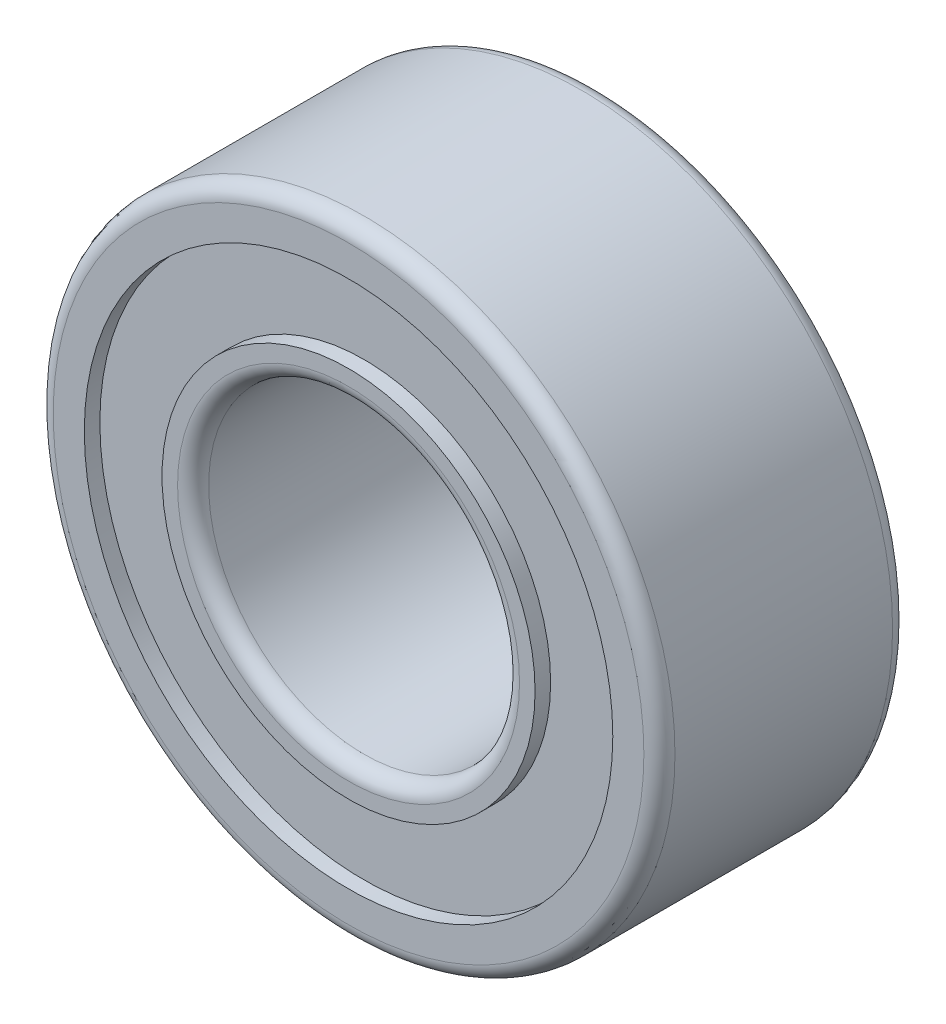
ISO-10303-21;
HEADER;
FILE_DESCRIPTION(('STEP AP214'),'2;1');
FILE_NAME('part.step','',(''),(''),'','','');
FILE_SCHEMA(('AUTOMOTIVE_DESIGN { 1 0 10303 214 1 1 1 1 }'));
ENDSEC;
DATA;
#1=APPLICATION_CONTEXT('core data for automotive mechanical design processes');
#2=APPLICATION_PROTOCOL_DEFINITION('international standard','automotive_design',2000,#1);
#3=PRODUCT_CONTEXT('',#1,'mechanical');
#4=PRODUCT('Part','Part','',(#3));
#5=PRODUCT_RELATED_PRODUCT_CATEGORY('part','',(#4));
#6=PRODUCT_DEFINITION_FORMATION('','',#4);
#7=PRODUCT_DEFINITION_CONTEXT('part definition',#1,'design');
#8=PRODUCT_DEFINITION('design','',#6,#7);
#9=PRODUCT_DEFINITION_SHAPE('','',#8);
#10=(LENGTH_UNIT() NAMED_UNIT(*) SI_UNIT(.MILLI.,.METRE.));
#11=(NAMED_UNIT(*) PLANE_ANGLE_UNIT() SI_UNIT($,.RADIAN.));
#12=(NAMED_UNIT(*) SI_UNIT($,.STERADIAN.) SOLID_ANGLE_UNIT());
#13=UNCERTAINTY_MEASURE_WITH_UNIT(LENGTH_MEASURE(1.E-05),#10,'distance_accuracy_value','');
#14=(GEOMETRIC_REPRESENTATION_CONTEXT(3) GLOBAL_UNCERTAINTY_ASSIGNED_CONTEXT((#13)) GLOBAL_UNIT_ASSIGNED_CONTEXT((#10,
#11,#12)) REPRESENTATION_CONTEXT('',''));
#15=CARTESIAN_POINT('',(0.,0.,0.));
#16=DIRECTION('',(0.,0.,1.));
#17=DIRECTION('',(1.,0.,0.));
#18=AXIS2_PLACEMENT_3D('',#15,#16,#17);
#19=CARTESIAN_POINT('',(0.,0.,0.));
#20=DIRECTION('',(0.,0.,1.));
#21=DIRECTION('',(1.,0.,0.));
#22=AXIS2_PLACEMENT_3D('',#19,#20,#21);
#23=PLANE('',#22);
#24=CARTESIAN_POINT('',(0.,0.,0.));
#25=DIRECTION('',(0.,0.,1.));
#26=DIRECTION('',(1.,0.,0.));
#27=AXIS2_PLACEMENT_3D('',#24,#25,#26);
#28=CIRCLE('',#27,2.75);
#29=CARTESIAN_POINT('',(2.75,0.,0.));
#30=VERTEX_POINT('',#29);
#31=EDGE_CURVE('E47',#30,#30,#28,.T.);
#32=ORIENTED_EDGE('',*,*,#31,.T.);
#33=EDGE_LOOP('',(#32));
#34=FACE_BOUND('',#33,.T.);
#35=CARTESIAN_POINT('',(0.,0.,0.));
#36=DIRECTION('',(0.,0.,-1.));
#37=DIRECTION('',(-1.,0.,0.));
#38=AXIS2_PLACEMENT_3D('',#35,#36,#37);
#39=CIRCLE('',#38,3.);
#40=CARTESIAN_POINT('',(-3.,0.,0.));
#41=VERTEX_POINT('',#40);
#42=EDGE_CURVE('E83',#41,#41,#39,.T.);
#43=ORIENTED_EDGE('',*,*,#42,.T.);
#44=EDGE_LOOP('',(#43));
#45=FACE_BOUND('',#44,.T.);
#46=ADVANCED_FACE('F32',(#34,#45),#23,.F.);
#47=CARTESIAN_POINT('',(0.,0.,4.));
#48=DIRECTION('',(0.,0.,1.));
#49=DIRECTION('',(1.,0.,0.));
#50=AXIS2_PLACEMENT_3D('',#47,#48,#49);
#51=PLANE('',#50);
#52=CARTESIAN_POINT('',(0.,0.,4.));
#53=DIRECTION('',(0.,0.,1.));
#54=DIRECTION('',(1.,0.,0.));
#55=AXIS2_PLACEMENT_3D('',#52,#53,#54);
#56=CIRCLE('',#55,2.75);
#57=CARTESIAN_POINT('',(2.75,0.,4.));
#58=VERTEX_POINT('',#57);
#59=EDGE_CURVE('E10',#58,#58,#56,.F.);
#60=ORIENTED_EDGE('',*,*,#59,.T.);
#61=EDGE_LOOP('',(#60));
#62=FACE_BOUND('',#61,.T.);
#63=CARTESIAN_POINT('',(0.,0.,4.));
#64=DIRECTION('',(0.,0.,1.));
#65=DIRECTION('',(1.,0.,0.));
#66=AXIS2_PLACEMENT_3D('',#63,#64,#65);
#67=CIRCLE('',#66,3.);
#68=CARTESIAN_POINT('',(3.,0.,4.));
#69=VERTEX_POINT('',#68);
#70=EDGE_CURVE('E71',#69,#69,#67,.T.);
#71=ORIENTED_EDGE('',*,*,#70,.T.);
#72=EDGE_LOOP('',(#71));
#73=FACE_BOUND('',#72,.T.);
#74=ADVANCED_FACE('F133',(#62,#73),#51,.T.);
#75=CARTESIAN_POINT('',(0.,0.,4.));
#76=DIRECTION('',(0.,0.,1.));
#77=DIRECTION('',(1.,0.,0.));
#78=AXIS2_PLACEMENT_3D('',#75,#76,#77);
#79=CIRCLE('',#78,4.25);
#80=CARTESIAN_POINT('',(4.25,0.,4.));
#81=VERTEX_POINT('',#80);
#82=EDGE_CURVE('E65',#81,#81,#79,.T.);
#83=ORIENTED_EDGE('',*,*,#82,.F.);
#84=EDGE_LOOP('',(#83));
#85=FACE_BOUND('',#84,.T.);
#86=CARTESIAN_POINT('',(0.,0.,4.));
#87=DIRECTION('',(0.,0.,1.));
#88=DIRECTION('',(1.,0.,0.));
#89=AXIS2_PLACEMENT_3D('',#86,#87,#88);
#90=CIRCLE('',#89,4.75);
#91=CARTESIAN_POINT('',(4.75,0.,4.));
#92=VERTEX_POINT('',#91);
#93=EDGE_CURVE('E52',#92,#92,#90,.T.);
#94=ORIENTED_EDGE('',*,*,#93,.T.);
#95=EDGE_LOOP('',(#94));
#96=FACE_BOUND('',#95,.T.);
#97=ADVANCED_FACE('F109',(#85,#96),#51,.T.);
#98=CARTESIAN_POINT('',(0.,0.,0.));
#99=DIRECTION('',(0.,0.,-1.));
#100=DIRECTION('',(-1.,0.,0.));
#101=AXIS2_PLACEMENT_3D('',#98,#99,#100);
#102=CIRCLE('',#101,4.25);
#103=CARTESIAN_POINT('',(-4.25,0.,0.));
#104=VERTEX_POINT('',#103);
#105=EDGE_CURVE('E77',#104,#104,#102,.T.);
#106=ORIENTED_EDGE('',*,*,#105,.F.);
#107=EDGE_LOOP('',(#106));
#108=FACE_BOUND('',#107,.T.);
#109=CARTESIAN_POINT('',(0.,0.,0.));
#110=DIRECTION('',(0.,0.,1.));
#111=DIRECTION('',(1.,0.,0.));
#112=AXIS2_PLACEMENT_3D('',#109,#110,#111);
#113=CIRCLE('',#112,4.75);
#114=CARTESIAN_POINT('',(4.75,0.,0.));
#115=VERTEX_POINT('',#114);
#116=EDGE_CURVE('E55',#115,#115,#113,.F.);
#117=ORIENTED_EDGE('',*,*,#116,.T.);
#118=EDGE_LOOP('',(#117));
#119=FACE_BOUND('',#118,.T.);
#120=ADVANCED_FACE('F105',(#108,#119),#23,.F.);
#121=CARTESIAN_POINT('',(0.,0.,4.));
#122=DIRECTION('',(0.,0.,-1.));
#123=DIRECTION('',(-1.,0.,0.));
#124=AXIS2_PLACEMENT_3D('',#121,#122,#123);
#125=CYLINDRICAL_SURFACE('',#124,5.);
#126=CARTESIAN_POINT('',(0.,0.,0.25));
#127=DIRECTION('',(0.,0.,1.));
#128=DIRECTION('',(1.,0.,0.));
#129=AXIS2_PLACEMENT_3D('',#126,#127,#128);
#130=CIRCLE('',#129,5.);
#131=CARTESIAN_POINT('',(5.,0.,0.25));
#132=VERTEX_POINT('',#131);
#133=EDGE_CURVE('E58',#132,#132,#130,.T.);
#134=ORIENTED_EDGE('',*,*,#133,.T.);
#135=EDGE_LOOP('',(#134));
#136=FACE_BOUND('',#135,.T.);
#137=CARTESIAN_POINT('',(0.,0.,3.75));
#138=DIRECTION('',(0.,0.,1.));
#139=DIRECTION('',(1.,0.,0.));
#140=AXIS2_PLACEMENT_3D('',#137,#138,#139);
#141=CIRCLE('',#140,5.);
#142=CARTESIAN_POINT('',(5.,0.,3.75));
#143=VERTEX_POINT('',#142);
#144=EDGE_CURVE('E61',#143,#143,#141,.F.);
#145=ORIENTED_EDGE('',*,*,#144,.T.);
#146=EDGE_LOOP('',(#145));
#147=FACE_BOUND('',#146,.T.);
#148=ADVANCED_FACE('F108',(#136,#147),#125,.T.);
#149=CARTESIAN_POINT('',(0.,0.,4.));
#150=DIRECTION('',(0.,0.,-1.));
#151=DIRECTION('',(-1.,0.,0.));
#152=AXIS2_PLACEMENT_3D('',#149,#150,#151);
#153=CYLINDRICAL_SURFACE('',#152,2.5);
#154=CARTESIAN_POINT('',(0.,0.,0.25));
#155=DIRECTION('',(0.,0.,1.));
#156=DIRECTION('',(1.,0.,0.));
#157=AXIS2_PLACEMENT_3D('',#154,#155,#156);
#158=CIRCLE('',#157,2.5);
#159=CARTESIAN_POINT('',(2.5,0.,0.25));
#160=VERTEX_POINT('',#159);
#161=EDGE_CURVE('E39',#160,#160,#158,.F.);
#162=ORIENTED_EDGE('',*,*,#161,.T.);
#163=EDGE_LOOP('',(#162));
#164=FACE_BOUND('',#163,.T.);
#165=CARTESIAN_POINT('',(0.,0.,3.75));
#166=DIRECTION('',(0.,0.,1.));
#167=DIRECTION('',(1.,0.,0.));
#168=AXIS2_PLACEMENT_3D('',#165,#166,#167);
#169=CIRCLE('',#168,2.5);
#170=CARTESIAN_POINT('',(2.5,0.,3.75));
#171=VERTEX_POINT('',#170);
#172=EDGE_CURVE('E43',#171,#171,#169,.T.);
#173=ORIENTED_EDGE('',*,*,#172,.T.);
#174=EDGE_LOOP('',(#173));
#175=FACE_BOUND('',#174,.T.);
#176=ADVANCED_FACE('F117',(#164,#175),#153,.F.);
#177=CARTESIAN_POINT('',(0.,0.,0.25));
#178=DIRECTION('',(0.,0.,1.));
#179=DIRECTION('',(1.,0.,0.));
#180=AXIS2_PLACEMENT_3D('',#177,#178,#179);
#181=TOROIDAL_SURFACE('',#180,4.75,0.25);
#182=ORIENTED_EDGE('',*,*,#116,.F.);
#183=EDGE_LOOP('',(#182));
#184=FACE_BOUND('',#183,.T.);
#185=ORIENTED_EDGE('',*,*,#133,.F.);
#186=EDGE_LOOP('',(#185));
#187=FACE_BOUND('',#186,.T.);
#188=ADVANCED_FACE('F113',(#184,#187),#181,.T.);
#189=CARTESIAN_POINT('',(0.,0.,3.75));
#190=DIRECTION('',(0.,0.,1.));
#191=DIRECTION('',(1.,0.,0.));
#192=AXIS2_PLACEMENT_3D('',#189,#190,#191);
#193=TOROIDAL_SURFACE('',#192,4.75,0.25);
#194=ORIENTED_EDGE('',*,*,#144,.F.);
#195=EDGE_LOOP('',(#194));
#196=FACE_BOUND('',#195,.T.);
#197=ORIENTED_EDGE('',*,*,#93,.F.);
#198=EDGE_LOOP('',(#197));
#199=FACE_BOUND('',#198,.T.);
#200=ADVANCED_FACE('F116',(#196,#199),#193,.T.);
#201=CARTESIAN_POINT('',(0.,0.,0.25));
#202=DIRECTION('',(0.,0.,1.));
#203=DIRECTION('',(1.,0.,0.));
#204=AXIS2_PLACEMENT_3D('',#201,#202,#203);
#205=TOROIDAL_SURFACE('',#204,2.75,0.25);
#206=ORIENTED_EDGE('',*,*,#161,.F.);
#207=EDGE_LOOP('',(#206));
#208=FACE_BOUND('',#207,.T.);
#209=ORIENTED_EDGE('',*,*,#31,.F.);
#210=EDGE_LOOP('',(#209));
#211=FACE_BOUND('',#210,.T.);
#212=ADVANCED_FACE('F128',(#208,#211),#205,.T.);
#213=CARTESIAN_POINT('',(0.,0.,3.75));
#214=DIRECTION('',(0.,0.,1.));
#215=DIRECTION('',(1.,0.,0.));
#216=AXIS2_PLACEMENT_3D('',#213,#214,#215);
#217=TOROIDAL_SURFACE('',#216,2.75,0.25);
#218=ORIENTED_EDGE('',*,*,#59,.F.);
#219=EDGE_LOOP('',(#218));
#220=FACE_BOUND('',#219,.T.);
#221=ORIENTED_EDGE('',*,*,#172,.F.);
#222=EDGE_LOOP('',(#221));
#223=FACE_BOUND('',#222,.T.);
#224=ADVANCED_FACE('F34',(#220,#223),#217,.T.);
#225=CARTESIAN_POINT('',(0.,0.,3.75));
#226=DIRECTION('',(0.,0.,1.));
#227=DIRECTION('',(1.,0.,0.));
#228=AXIS2_PLACEMENT_3D('',#225,#226,#227);
#229=CYLINDRICAL_SURFACE('',#228,4.25);
#230=CARTESIAN_POINT('',(0.,0.,3.75));
#231=DIRECTION('',(0.,0.,1.));
#232=DIRECTION('',(1.,0.,0.));
#233=AXIS2_PLACEMENT_3D('',#230,#231,#232);
#234=CIRCLE('',#233,4.25);
#235=CARTESIAN_POINT('',(4.25,0.,3.75));
#236=VERTEX_POINT('',#235);
#237=EDGE_CURVE('E64',#236,#236,#234,.T.);
#238=ORIENTED_EDGE('',*,*,#237,.F.);
#239=EDGE_LOOP('',(#238));
#240=FACE_BOUND('',#239,.T.);
#241=ORIENTED_EDGE('',*,*,#82,.T.);
#242=EDGE_LOOP('',(#241));
#243=FACE_BOUND('',#242,.T.);
#244=ADVANCED_FACE('F151',(#240,#243),#229,.F.);
#245=CARTESIAN_POINT('',(0.,0.,3.75));
#246=DIRECTION('',(0.,0.,1.));
#247=DIRECTION('',(1.,0.,0.));
#248=AXIS2_PLACEMENT_3D('',#245,#246,#247);
#249=PLANE('',#248);
#250=CARTESIAN_POINT('',(0.,0.,3.75));
#251=DIRECTION('',(0.,0.,1.));
#252=DIRECTION('',(1.,0.,0.));
#253=AXIS2_PLACEMENT_3D('',#250,#251,#252);
#254=CIRCLE('',#253,3.);
#255=CARTESIAN_POINT('',(3.,0.,3.75));
#256=VERTEX_POINT('',#255);
#257=EDGE_CURVE('E68',#256,#256,#254,.T.);
#258=ORIENTED_EDGE('',*,*,#257,.F.);
#259=EDGE_LOOP('',(#258));
#260=FACE_BOUND('',#259,.T.);
#261=ORIENTED_EDGE('',*,*,#237,.T.);
#262=EDGE_LOOP('',(#261));
#263=FACE_BOUND('',#262,.T.);
#264=ADVANCED_FACE('F158',(#260,#263),#249,.T.);
#265=CARTESIAN_POINT('',(0.,0.,3.75));
#266=DIRECTION('',(0.,0.,1.));
#267=DIRECTION('',(1.,0.,0.));
#268=AXIS2_PLACEMENT_3D('',#265,#266,#267);
#269=CYLINDRICAL_SURFACE('',#268,3.);
#270=ORIENTED_EDGE('',*,*,#257,.T.);
#271=EDGE_LOOP('',(#270));
#272=FACE_BOUND('',#271,.T.);
#273=ORIENTED_EDGE('',*,*,#70,.F.);
#274=EDGE_LOOP('',(#273));
#275=FACE_BOUND('',#274,.T.);
#276=ADVANCED_FACE('F101',(#272,#275),#269,.T.);
#277=CARTESIAN_POINT('',(0.,0.,0.25));
#278=DIRECTION('',(0.,0.,-1.));
#279=DIRECTION('',(-1.,0.,0.));
#280=AXIS2_PLACEMENT_3D('',#277,#278,#279);
#281=CYLINDRICAL_SURFACE('',#280,4.25);
#282=CARTESIAN_POINT('',(0.,0.,0.25));
#283=DIRECTION('',(0.,0.,-1.));
#284=DIRECTION('',(-1.,0.,0.));
#285=AXIS2_PLACEMENT_3D('',#282,#283,#284);
#286=CIRCLE('',#285,4.25);
#287=CARTESIAN_POINT('',(-4.25,0.,0.25));
#288=VERTEX_POINT('',#287);
#289=EDGE_CURVE('E74',#288,#288,#286,.T.);
#290=ORIENTED_EDGE('',*,*,#289,.F.);
#291=EDGE_LOOP('',(#290));
#292=FACE_BOUND('',#291,.T.);
#293=ORIENTED_EDGE('',*,*,#105,.T.);
#294=EDGE_LOOP('',(#293));
#295=FACE_BOUND('',#294,.T.);
#296=ADVANCED_FACE('F95',(#292,#295),#281,.F.);
#297=CARTESIAN_POINT('',(0.,0.,0.25));
#298=DIRECTION('',(0.,0.,-1.));
#299=DIRECTION('',(-1.,0.,0.));
#300=AXIS2_PLACEMENT_3D('',#297,#298,#299);
#301=PLANE('',#300);
#302=CARTESIAN_POINT('',(0.,0.,0.25));
#303=DIRECTION('',(0.,0.,-1.));
#304=DIRECTION('',(-1.,0.,0.));
#305=AXIS2_PLACEMENT_3D('',#302,#303,#304);
#306=CIRCLE('',#305,3.);
#307=CARTESIAN_POINT('',(-3.,0.,0.25));
#308=VERTEX_POINT('',#307);
#309=EDGE_CURVE('E80',#308,#308,#306,.T.);
#310=ORIENTED_EDGE('',*,*,#309,.F.);
#311=EDGE_LOOP('',(#310));
#312=FACE_BOUND('',#311,.T.);
#313=ORIENTED_EDGE('',*,*,#289,.T.);
#314=EDGE_LOOP('',(#313));
#315=FACE_BOUND('',#314,.T.);
#316=ADVANCED_FACE('F92',(#312,#315),#301,.T.);
#317=CARTESIAN_POINT('',(0.,0.,0.25));
#318=DIRECTION('',(0.,0.,-1.));
#319=DIRECTION('',(-1.,0.,0.));
#320=AXIS2_PLACEMENT_3D('',#317,#318,#319);
#321=CYLINDRICAL_SURFACE('',#320,3.);
#322=ORIENTED_EDGE('',*,*,#309,.T.);
#323=EDGE_LOOP('',(#322));
#324=FACE_BOUND('',#323,.T.);
#325=ORIENTED_EDGE('',*,*,#42,.F.);
#326=EDGE_LOOP('',(#325));
#327=FACE_BOUND('',#326,.T.);
#328=ADVANCED_FACE('F89',(#324,#327),#321,.T.);
#329=CLOSED_SHELL('',(#46,#74,#97,#120,#148,#176,#188,#200,#212,#224,#244,#264,#276,#296,#316,#328));
#330=MANIFOLD_SOLID_BREP('B2',#329);
#331=ADVANCED_BREP_SHAPE_REPRESENTATION('',(#18,#330),#14);
#332=SHAPE_DEFINITION_REPRESENTATION(#9,#331);
ENDSEC;
END-ISO-10303-21;
